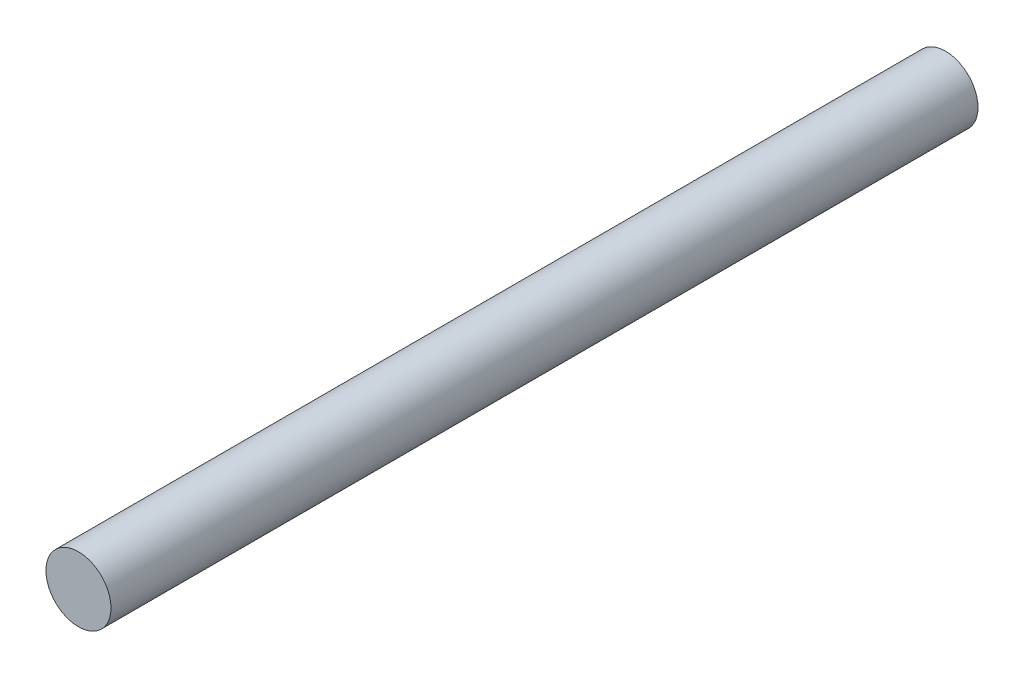
ISO-10303-21;
HEADER;
FILE_DESCRIPTION(('STEP AP214'),'2;1');
FILE_NAME('part.step','',(''),(''),'','','');
FILE_SCHEMA(('AUTOMOTIVE_DESIGN { 1 0 10303 214 1 1 1 1 }'));
ENDSEC;
DATA;
#1=APPLICATION_CONTEXT('core data for automotive mechanical design processes');
#2=APPLICATION_PROTOCOL_DEFINITION('international standard','automotive_design',2000,#1);
#3=PRODUCT_CONTEXT('',#1,'mechanical');
#4=PRODUCT('Part','Part','',(#3));
#5=PRODUCT_RELATED_PRODUCT_CATEGORY('part','',(#4));
#6=PRODUCT_DEFINITION_FORMATION('','',#4);
#7=PRODUCT_DEFINITION_CONTEXT('part definition',#1,'design');
#8=PRODUCT_DEFINITION('design','',#6,#7);
#9=PRODUCT_DEFINITION_SHAPE('','',#8);
#10=(LENGTH_UNIT() NAMED_UNIT(*) SI_UNIT(.MILLI.,.METRE.));
#11=(NAMED_UNIT(*) PLANE_ANGLE_UNIT() SI_UNIT($,.RADIAN.));
#12=(NAMED_UNIT(*) SI_UNIT($,.STERADIAN.) SOLID_ANGLE_UNIT());
#13=UNCERTAINTY_MEASURE_WITH_UNIT(LENGTH_MEASURE(1.E-05),#10,'distance_accuracy_value','');
#14=(GEOMETRIC_REPRESENTATION_CONTEXT(3) GLOBAL_UNCERTAINTY_ASSIGNED_CONTEXT((#13)) GLOBAL_UNIT_ASSIGNED_CONTEXT((#10,
#11,#12)) REPRESENTATION_CONTEXT('',''));
#15=CARTESIAN_POINT('',(0.,0.,0.));
#16=DIRECTION('',(0.,0.,1.));
#17=DIRECTION('',(1.,0.,0.));
#18=AXIS2_PLACEMENT_3D('',#15,#16,#17);
#19=CARTESIAN_POINT('',(0.,0.,127.));
#20=DIRECTION('',(0.,0.,-1.));
#21=DIRECTION('',(-1.,0.,0.));
#22=AXIS2_PLACEMENT_3D('',#19,#20,#21);
#23=CYLINDRICAL_SURFACE('',#22,4.7625);
#24=CARTESIAN_POINT('',(0.,0.,127.));
#25=DIRECTION('',(0.,0.,1.));
#26=DIRECTION('',(1.,0.,0.));
#27=AXIS2_PLACEMENT_3D('',#24,#25,#26);
#28=CIRCLE('',#27,4.7625);
#29=CARTESIAN_POINT('',(4.7625,0.,127.));
#30=VERTEX_POINT('',#29);
#31=EDGE_CURVE('E10',#30,#30,#28,.T.);
#32=ORIENTED_EDGE('',*,*,#31,.F.);
#33=EDGE_LOOP('',(#32));
#34=FACE_BOUND('',#33,.T.);
#35=CARTESIAN_POINT('',(0.,0.,0.));
#36=DIRECTION('',(0.,0.,1.));
#37=DIRECTION('',(1.,0.,0.));
#38=AXIS2_PLACEMENT_3D('',#35,#36,#37);
#39=CIRCLE('',#38,4.7625);
#40=CARTESIAN_POINT('',(4.7625,0.,0.));
#41=VERTEX_POINT('',#40);
#42=EDGE_CURVE('E40',#41,#41,#39,.T.);
#43=ORIENTED_EDGE('',*,*,#42,.T.);
#44=EDGE_LOOP('',(#43));
#45=FACE_BOUND('',#44,.T.);
#46=ADVANCED_FACE('F37',(#34,#45),#23,.T.);
#47=CARTESIAN_POINT('',(0.,0.,127.));
#48=DIRECTION('',(0.,0.,1.));
#49=DIRECTION('',(1.,0.,0.));
#50=AXIS2_PLACEMENT_3D('',#47,#48,#49);
#51=PLANE('',#50);
#52=ORIENTED_EDGE('',*,*,#31,.T.);
#53=EDGE_LOOP('',(#52));
#54=FACE_BOUND('',#53,.T.);
#55=ADVANCED_FACE('F54',(#54),#51,.T.);
#56=CARTESIAN_POINT('',(0.,0.,0.));
#57=DIRECTION('',(0.,0.,1.));
#58=DIRECTION('',(1.,0.,0.));
#59=AXIS2_PLACEMENT_3D('',#56,#57,#58);
#60=PLANE('',#59);
#61=ORIENTED_EDGE('',*,*,#42,.F.);
#62=EDGE_LOOP('',(#61));
#63=FACE_BOUND('',#62,.T.);
#64=ADVANCED_FACE('F52',(#63),#60,.F.);
#65=CLOSED_SHELL('',(#46,#55,#64));
#66=MANIFOLD_SOLID_BREP('B2',#65);
#67=ADVANCED_BREP_SHAPE_REPRESENTATION('',(#18,#66),#14);
#68=SHAPE_DEFINITION_REPRESENTATION(#9,#67);
ENDSEC;
END-ISO-10303-21;
